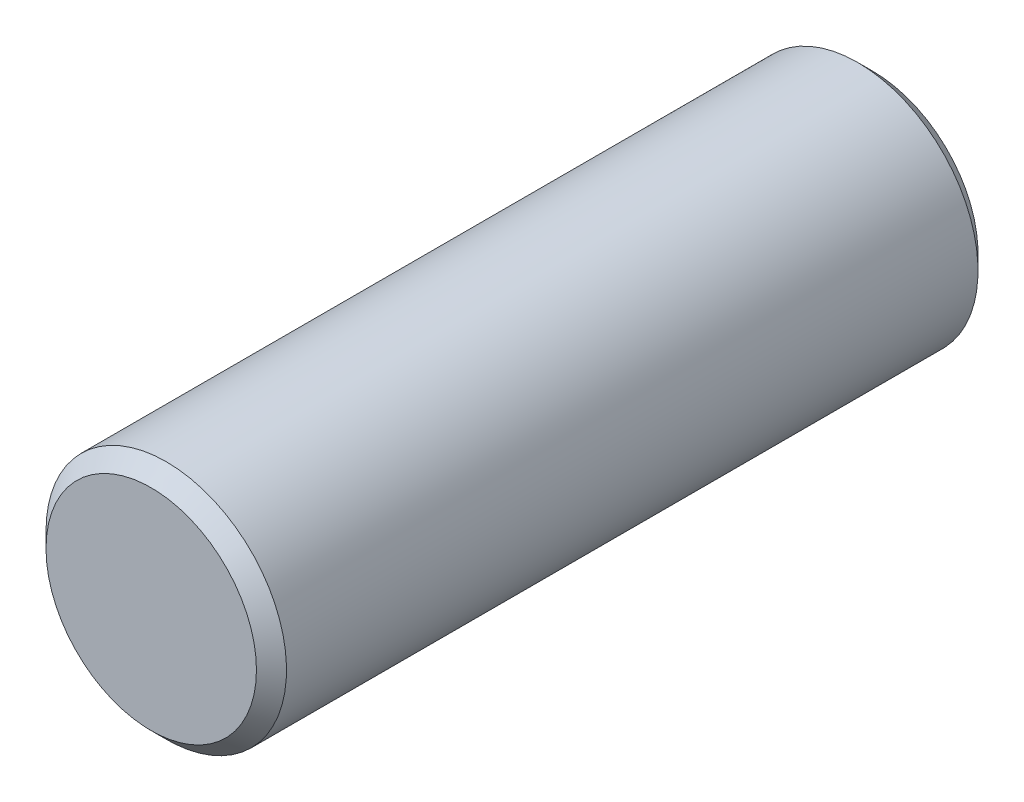
ISO-10303-21;
HEADER;
FILE_DESCRIPTION(('STEP AP214'),'2;1');
FILE_NAME('part.step','',(''),(''),'','','');
FILE_SCHEMA(('AUTOMOTIVE_DESIGN { 1 0 10303 214 1 1 1 1 }'));
ENDSEC;
DATA;
#1=APPLICATION_CONTEXT('core data for automotive mechanical design processes');
#2=APPLICATION_PROTOCOL_DEFINITION('international standard','automotive_design',2000,#1);
#3=PRODUCT_CONTEXT('',#1,'mechanical');
#4=PRODUCT('Part','Part','',(#3));
#5=PRODUCT_RELATED_PRODUCT_CATEGORY('part','',(#4));
#6=PRODUCT_DEFINITION_FORMATION('','',#4);
#7=PRODUCT_DEFINITION_CONTEXT('part definition',#1,'design');
#8=PRODUCT_DEFINITION('design','',#6,#7);
#9=PRODUCT_DEFINITION_SHAPE('','',#8);
#10=(LENGTH_UNIT() NAMED_UNIT(*) SI_UNIT(.MILLI.,.METRE.));
#11=(NAMED_UNIT(*) PLANE_ANGLE_UNIT() SI_UNIT($,.RADIAN.));
#12=(NAMED_UNIT(*) SI_UNIT($,.STERADIAN.) SOLID_ANGLE_UNIT());
#13=UNCERTAINTY_MEASURE_WITH_UNIT(LENGTH_MEASURE(1.E-05),#10,'distance_accuracy_value','');
#14=(GEOMETRIC_REPRESENTATION_CONTEXT(3) GLOBAL_UNCERTAINTY_ASSIGNED_CONTEXT((#13)) GLOBAL_UNIT_ASSIGNED_CONTEXT((#10,
#11,#12)) REPRESENTATION_CONTEXT('',''));
#15=CARTESIAN_POINT('',(0.,0.,0.));
#16=DIRECTION('',(0.,0.,1.));
#17=DIRECTION('',(1.,0.,0.));
#18=AXIS2_PLACEMENT_3D('',#15,#16,#17);
#19=CARTESIAN_POINT('',(0.,0.,5.99999999999999));
#20=DIRECTION('',(0.,0.,1.));
#21=DIRECTION('',(0.,-1.,0.));
#22=AXIS2_PLACEMENT_3D('',#19,#20,#21);
#23=PLANE('',#22);
#24=CARTESIAN_POINT('',(0.,0.,6.00000000002865));
#25=DIRECTION('',(0.,0.,-1.));
#26=DIRECTION('',(-1.,0.,0.));
#27=AXIS2_PLACEMENT_3D('',#24,#25,#26);
#28=CIRCLE('',#27,1.74999999995862);
#29=CARTESIAN_POINT('',(-1.74999999995862,0.,6.00000000002865));
#30=VERTEX_POINT('',#29);
#31=EDGE_CURVE('E17',#30,#30,#28,.T.);
#32=ORIENTED_EDGE('',*,*,#31,.F.);
#33=EDGE_LOOP('',(#32));
#34=FACE_BOUND('',#33,.T.);
#35=ADVANCED_FACE('F14',(#34),#23,.T.);
#36=CARTESIAN_POINT('',(0.,0.,-6.));
#37=DIRECTION('',(0.,0.,1.));
#38=DIRECTION('',(0.,-1.,0.));
#39=AXIS2_PLACEMENT_3D('',#36,#37,#38);
#40=PLANE('',#39);
#41=CARTESIAN_POINT('',(0.,0.,-6.00000000002865));
#42=DIRECTION('',(0.,0.,1.));
#43=DIRECTION('',(0.,-1.,0.));
#44=AXIS2_PLACEMENT_3D('',#41,#42,#43);
#45=CIRCLE('',#44,1.75000000001546);
#46=CARTESIAN_POINT('',(0.,-1.75000000001546,-6.00000000002865));
#47=VERTEX_POINT('',#46);
#48=EDGE_CURVE('E26',#47,#47,#45,.T.);
#49=ORIENTED_EDGE('',*,*,#48,.F.);
#50=EDGE_LOOP('',(#49));
#51=FACE_BOUND('',#50,.T.);
#52=ADVANCED_FACE('F37',(#51),#40,.F.);
#53=CARTESIAN_POINT('',(0.,0.,5.75000000003456));
#54=DIRECTION('',(0.,0.,-1.));
#55=DIRECTION('',(-1.,0.,0.));
#56=AXIS2_PLACEMENT_3D('',#53,#54,#55);
#57=CONICAL_SURFACE('',#56,1.99999999995271,0.785398163397448);
#58=CARTESIAN_POINT('',(0.,0.,5.74999999999999));
#59=DIRECTION('',(0.,0.,-1.));
#60=DIRECTION('',(0.,1.,0.));
#61=AXIS2_PLACEMENT_3D('',#58,#59,#60);
#62=CIRCLE('',#61,2.);
#63=CARTESIAN_POINT('',(0.,2.,5.74999999999999));
#64=VERTEX_POINT('',#63);
#65=EDGE_CURVE('E21',#64,#64,#62,.T.);
#66=ORIENTED_EDGE('',*,*,#65,.F.);
#67=EDGE_LOOP('',(#66));
#68=FACE_BOUND('',#67,.T.);
#69=ORIENTED_EDGE('',*,*,#31,.T.);
#70=EDGE_LOOP('',(#69));
#71=FACE_BOUND('',#70,.T.);
#72=ADVANCED_FACE('F34',(#68,#71),#57,.T.);
#73=CARTESIAN_POINT('',(0.,0.,-5.7500000000914));
#74=DIRECTION('',(0.,0.,1.));
#75=DIRECTION('',(0.,-1.,0.));
#76=AXIS2_PLACEMENT_3D('',#73,#74,#75);
#77=CONICAL_SURFACE('',#76,1.99999999989586,0.785398163283761);
#78=CARTESIAN_POINT('',(0.,0.,-5.75));
#79=DIRECTION('',(0.,0.,-1.));
#80=DIRECTION('',(0.,1.,0.));
#81=AXIS2_PLACEMENT_3D('',#78,#79,#80);
#82=CIRCLE('',#81,2.);
#83=CARTESIAN_POINT('',(0.,2.,-5.75));
#84=VERTEX_POINT('',#83);
#85=EDGE_CURVE('E9',#84,#84,#82,.F.);
#86=ORIENTED_EDGE('',*,*,#85,.F.);
#87=EDGE_LOOP('',(#86));
#88=FACE_BOUND('',#87,.T.);
#89=ORIENTED_EDGE('',*,*,#48,.T.);
#90=EDGE_LOOP('',(#89));
#91=FACE_BOUND('',#90,.T.);
#92=ADVANCED_FACE('F45',(#88,#91),#77,.T.);
#93=CARTESIAN_POINT('',(0.,0.,5.99999999999999));
#94=DIRECTION('',(0.,0.,-1.));
#95=DIRECTION('',(0.,1.,0.));
#96=AXIS2_PLACEMENT_3D('',#93,#94,#95);
#97=CYLINDRICAL_SURFACE('',#96,2.);
#98=ORIENTED_EDGE('',*,*,#85,.T.);
#99=EDGE_LOOP('',(#98));
#100=FACE_BOUND('',#99,.T.);
#101=ORIENTED_EDGE('',*,*,#65,.T.);
#102=EDGE_LOOP('',(#101));
#103=FACE_BOUND('',#102,.T.);
#104=ADVANCED_FACE('F43',(#100,#103),#97,.T.);
#105=CLOSED_SHELL('',(#35,#52,#72,#92,#104));
#106=MANIFOLD_SOLID_BREP('B1',#105);
#107=ADVANCED_BREP_SHAPE_REPRESENTATION('',(#18,#106),#14);
#108=SHAPE_DEFINITION_REPRESENTATION(#9,#107);
ENDSEC;
END-ISO-10303-21;
